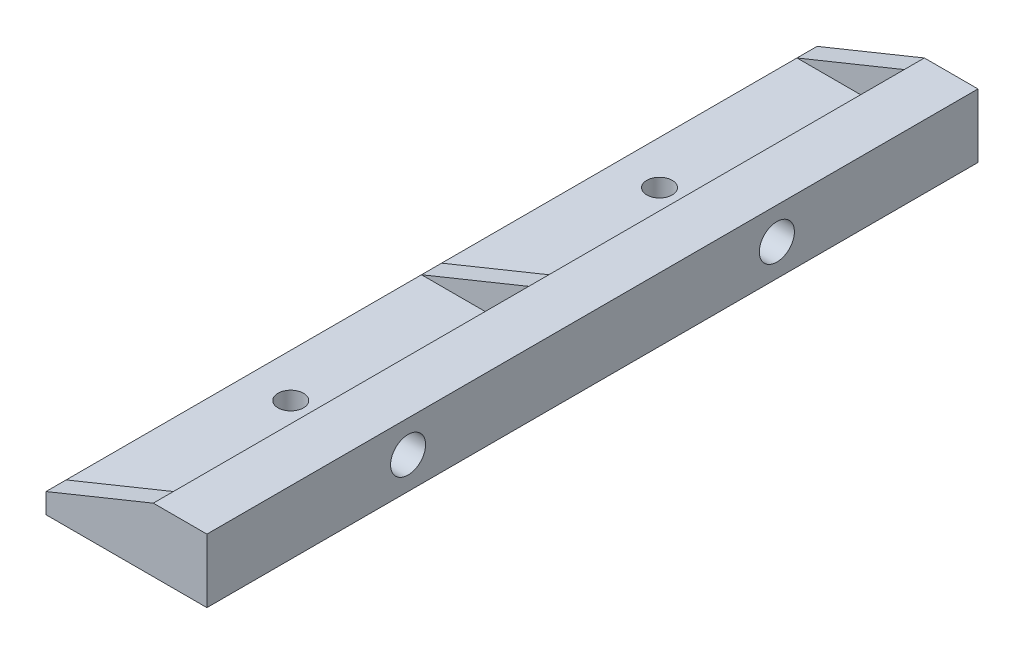
ISO-10303-21;
HEADER;
FILE_DESCRIPTION(('STEP AP214'),'2;1');
FILE_NAME('part.step','',(''),(''),'','','');
FILE_SCHEMA(('AUTOMOTIVE_DESIGN { 1 0 10303 214 1 1 1 1 }'));
ENDSEC;
DATA;
#1=APPLICATION_CONTEXT('core data for automotive mechanical design processes');
#2=APPLICATION_PROTOCOL_DEFINITION('international standard','automotive_design',2000,#1);
#3=PRODUCT_CONTEXT('',#1,'mechanical');
#4=PRODUCT('Part','Part','',(#3));
#5=PRODUCT_RELATED_PRODUCT_CATEGORY('part','',(#4));
#6=PRODUCT_DEFINITION_FORMATION('','',#4);
#7=PRODUCT_DEFINITION_CONTEXT('part definition',#1,'design');
#8=PRODUCT_DEFINITION('design','',#6,#7);
#9=PRODUCT_DEFINITION_SHAPE('','',#8);
#10=(LENGTH_UNIT() NAMED_UNIT(*) SI_UNIT(.MILLI.,.METRE.));
#11=(NAMED_UNIT(*) PLANE_ANGLE_UNIT() SI_UNIT($,.RADIAN.));
#12=(NAMED_UNIT(*) SI_UNIT($,.STERADIAN.) SOLID_ANGLE_UNIT());
#13=UNCERTAINTY_MEASURE_WITH_UNIT(LENGTH_MEASURE(1.E-05),#10,'distance_accuracy_value','');
#14=(GEOMETRIC_REPRESENTATION_CONTEXT(3) GLOBAL_UNCERTAINTY_ASSIGNED_CONTEXT((#13)) GLOBAL_UNIT_ASSIGNED_CONTEXT((#10,
#11,#12)) REPRESENTATION_CONTEXT('',''));
#15=CARTESIAN_POINT('',(0.,0.,0.));
#16=DIRECTION('',(0.,0.,1.));
#17=DIRECTION('',(1.,0.,0.));
#18=AXIS2_PLACEMENT_3D('',#15,#16,#17);
#19=CARTESIAN_POINT('',(-11.,6.,115.));
#20=DIRECTION('',(0.,0.,-1.));
#21=DIRECTION('',(-1.,0.,0.));
#22=AXIS2_PLACEMENT_3D('',#19,#20,#21);
#23=CYLINDRICAL_SURFACE('',#22,3.);
#24=CARTESIAN_POINT('',(-11.,6.,112.));
#25=DIRECTION('',(0.,0.,1.));
#26=DIRECTION('',(1.,0.,0.));
#27=AXIS2_PLACEMENT_3D('',#24,#25,#26);
#28=CIRCLE('',#27,3.);
#29=CARTESIAN_POINT('',(-8.,6.,112.));
#30=VERTEX_POINT('',#29);
#31=CARTESIAN_POINT('',(-11.,3.,112.));
#32=VERTEX_POINT('',#31);
#33=EDGE_CURVE('E231',#30,#32,#28,.F.);
#34=ORIENTED_EDGE('',*,*,#33,.F.);
#35=DIRECTION('',(0.,0.,-1.));
#36=VECTOR('',#35,1.);
#37=CARTESIAN_POINT('',(-8.,6.,115.));
#38=LINE('',#37,#36);
#39=CARTESIAN_POINT('',(-8.,6.,59.));
#40=VERTEX_POINT('',#39);
#41=EDGE_CURVE('E177',#30,#40,#38,.T.);
#42=ORIENTED_EDGE('',*,*,#41,.T.);
#43=CARTESIAN_POINT('',(-11.,6.,59.));
#44=DIRECTION('',(0.,0.,-1.));
#45=DIRECTION('',(-1.,0.,0.));
#46=AXIS2_PLACEMENT_3D('',#43,#44,#45);
#47=CIRCLE('',#46,3.);
#48=CARTESIAN_POINT('',(-11.,3.,59.));
#49=VERTEX_POINT('',#48);
#50=EDGE_CURVE('E208',#49,#40,#47,.F.);
#51=ORIENTED_EDGE('',*,*,#50,.F.);
#52=DIRECTION('',(0.,0.,-1.));
#53=VECTOR('',#52,1.);
#54=CARTESIAN_POINT('',(-11.,3.,115.));
#55=LINE('',#54,#53);
#56=EDGE_CURVE('E280',#32,#49,#55,.T.);
#57=ORIENTED_EDGE('',*,*,#56,.F.);
#58=EDGE_LOOP('',(#34,#42,#51,#57));
#59=FACE_BOUND('',#58,.T.);
#60=ADVANCED_FACE('F38',(#59),#23,.F.);
#61=CARTESIAN_POINT('',(-11.,3.,115.));
#62=DIRECTION('',(0.,-1.,0.));
#63=DIRECTION('',(1.,0.,0.));
#64=AXIS2_PLACEMENT_3D('',#61,#62,#63);
#65=PLANE('',#64);
#66=CARTESIAN_POINT('',(-17.5,3.,85.));
#67=DIRECTION('',(0.,-1.,0.));
#68=DIRECTION('',(1.,0.,0.));
#69=AXIS2_PLACEMENT_3D('',#66,#67,#68);
#70=CIRCLE('',#69,1.89865);
#71=CARTESIAN_POINT('',(-15.60135,3.,85.));
#72=VERTEX_POINT('',#71);
#73=EDGE_CURVE('E238',#72,#72,#70,.T.);
#74=ORIENTED_EDGE('',*,*,#73,.T.);
#75=EDGE_LOOP('',(#74));
#76=FACE_BOUND('',#75,.T.);
#77=DIRECTION('',(-1.,0.,0.));
#78=VECTOR('',#77,1.);
#79=CARTESIAN_POINT('',(-11.,3.,112.));
#80=LINE('',#79,#78);
#81=CARTESIAN_POINT('',(-24.,3.,112.));
#82=VERTEX_POINT('',#81);
#83=EDGE_CURVE('E235',#32,#82,#80,.T.);
#84=ORIENTED_EDGE('',*,*,#83,.F.);
#85=ORIENTED_EDGE('',*,*,#56,.T.);
#86=DIRECTION('',(1.,0.,0.));
#87=VECTOR('',#86,1.);
#88=CARTESIAN_POINT('',(-11.,3.,59.));
#89=LINE('',#88,#87);
#90=CARTESIAN_POINT('',(-24.,3.,59.));
#91=VERTEX_POINT('',#90);
#92=EDGE_CURVE('E212',#91,#49,#89,.T.);
#93=ORIENTED_EDGE('',*,*,#92,.F.);
#94=DIRECTION('',(0.,0.,-1.));
#95=VECTOR('',#94,1.);
#96=CARTESIAN_POINT('',(-24.,3.,115.));
#97=LINE('',#96,#95);
#98=EDGE_CURVE('E284',#82,#91,#97,.T.);
#99=ORIENTED_EDGE('',*,*,#98,.F.);
#100=EDGE_LOOP('',(#84,#85,#93,#99));
#101=FACE_BOUND('',#100,.T.);
#102=ADVANCED_FACE('F325',(#76,#101),#65,.F.);
#103=CARTESIAN_POINT('',(-8.,9.5,115.));
#104=DIRECTION('',(1.,0.,0.));
#105=DIRECTION('',(0.,0.,-1.));
#106=AXIS2_PLACEMENT_3D('',#103,#104,#105);
#107=PLANE('',#106);
#108=DIRECTION('',(0.,-1.,0.));
#109=VECTOR('',#108,1.);
#110=CARTESIAN_POINT('',(-8.,9.5,112.));
#111=LINE('',#110,#109);
#112=CARTESIAN_POINT('',(-8.,9.5,112.));
#113=VERTEX_POINT('',#112);
#114=EDGE_CURVE('E148',#113,#30,#111,.T.);
#115=ORIENTED_EDGE('',*,*,#114,.F.);
#116=DIRECTION('',(0.,0.,-1.));
#117=VECTOR('',#116,1.);
#118=CARTESIAN_POINT('',(-8.,9.5,115.));
#119=LINE('',#118,#117);
#120=CARTESIAN_POINT('',(-8.,9.5,59.));
#121=VERTEX_POINT('',#120);
#122=EDGE_CURVE('E163',#113,#121,#119,.T.);
#123=ORIENTED_EDGE('',*,*,#122,.T.);
#124=DIRECTION('',(0.,1.,0.));
#125=VECTOR('',#124,1.);
#126=CARTESIAN_POINT('',(-8.,9.5,59.));
#127=LINE('',#126,#125);
#128=EDGE_CURVE('E277',#40,#121,#127,.T.);
#129=ORIENTED_EDGE('',*,*,#128,.F.);
#130=ORIENTED_EDGE('',*,*,#41,.F.);
#131=EDGE_LOOP('',(#115,#123,#129,#130));
#132=FACE_BOUND('',#131,.T.);
#133=ADVANCED_FACE('F331',(#132),#107,.F.);
#134=CARTESIAN_POINT('',(-11.,6.,3.));
#135=DIRECTION('',(0.,0.,-1.));
#136=DIRECTION('',(-1.,0.,0.));
#137=AXIS2_PLACEMENT_3D('',#134,#135,#136);
#138=CIRCLE('',#137,3.);
#139=CARTESIAN_POINT('',(-11.,3.,3.));
#140=VERTEX_POINT('',#139);
#141=CARTESIAN_POINT('',(-8.,6.,3.));
#142=VERTEX_POINT('',#141);
#143=EDGE_CURVE('E55',#140,#142,#138,.F.);
#144=ORIENTED_EDGE('',*,*,#143,.F.);
#145=CARTESIAN_POINT('',(-11.,3.,56.));
#146=VERTEX_POINT('',#145);
#147=EDGE_CURVE('E282',#146,#140,#55,.T.);
#148=ORIENTED_EDGE('',*,*,#147,.F.);
#149=CARTESIAN_POINT('',(-11.,6.,56.));
#150=DIRECTION('',(0.,0.,-1.));
#151=DIRECTION('',(-1.,0.,0.));
#152=AXIS2_PLACEMENT_3D('',#149,#150,#151);
#153=CIRCLE('',#152,3.);
#154=CARTESIAN_POINT('',(-8.,6.,56.));
#155=VERTEX_POINT('',#154);
#156=EDGE_CURVE('E206',#146,#155,#153,.F.);
#157=ORIENTED_EDGE('',*,*,#156,.T.);
#158=EDGE_CURVE('E158',#155,#142,#38,.T.);
#159=ORIENTED_EDGE('',*,*,#158,.T.);
#160=EDGE_LOOP('',(#144,#148,#157,#159));
#161=FACE_BOUND('',#160,.T.);
#162=ADVANCED_FACE('F40',(#161),#23,.F.);
#163=CARTESIAN_POINT('',(-17.5,3.,30.));
#164=DIRECTION('',(0.,-1.,0.));
#165=DIRECTION('',(1.,0.,0.));
#166=AXIS2_PLACEMENT_3D('',#163,#164,#165);
#167=CIRCLE('',#166,1.89865);
#168=CARTESIAN_POINT('',(-15.60135,3.,30.));
#169=VERTEX_POINT('',#168);
#170=EDGE_CURVE('E243',#169,#169,#167,.T.);
#171=ORIENTED_EDGE('',*,*,#170,.T.);
#172=EDGE_LOOP('',(#171));
#173=FACE_BOUND('',#172,.T.);
#174=DIRECTION('',(1.,0.,0.));
#175=VECTOR('',#174,1.);
#176=CARTESIAN_POINT('',(-11.,3.,3.));
#177=LINE('',#176,#175);
#178=CARTESIAN_POINT('',(-24.,3.,3.));
#179=VERTEX_POINT('',#178);
#180=EDGE_CURVE('E62',#179,#140,#177,.T.);
#181=ORIENTED_EDGE('',*,*,#180,.F.);
#182=CARTESIAN_POINT('',(-24.,3.,56.));
#183=VERTEX_POINT('',#182);
#184=EDGE_CURVE('E285',#183,#179,#97,.T.);
#185=ORIENTED_EDGE('',*,*,#184,.F.);
#186=DIRECTION('',(1.,0.,0.));
#187=VECTOR('',#186,1.);
#188=CARTESIAN_POINT('',(-11.,3.,56.));
#189=LINE('',#188,#187);
#190=EDGE_CURVE('E205',#183,#146,#189,.T.);
#191=ORIENTED_EDGE('',*,*,#190,.T.);
#192=ORIENTED_EDGE('',*,*,#147,.T.);
#193=EDGE_LOOP('',(#181,#185,#191,#192));
#194=FACE_BOUND('',#193,.T.);
#195=ADVANCED_FACE('F333',(#173,#194),#65,.F.);
#196=DIRECTION('',(0.,1.,0.));
#197=VECTOR('',#196,1.);
#198=CARTESIAN_POINT('',(-8.,9.5,3.));
#199=LINE('',#198,#197);
#200=CARTESIAN_POINT('',(-8.,9.5,3.));
#201=VERTEX_POINT('',#200);
#202=EDGE_CURVE('E12',#142,#201,#199,.T.);
#203=ORIENTED_EDGE('',*,*,#202,.F.);
#204=ORIENTED_EDGE('',*,*,#158,.F.);
#205=DIRECTION('',(0.,1.,0.));
#206=VECTOR('',#205,1.);
#207=CARTESIAN_POINT('',(-8.,9.5,56.));
#208=LINE('',#207,#206);
#209=CARTESIAN_POINT('',(-8.,9.5,56.));
#210=VERTEX_POINT('',#209);
#211=EDGE_CURVE('E47',#155,#210,#208,.T.);
#212=ORIENTED_EDGE('',*,*,#211,.T.);
#213=EDGE_CURVE('E169',#210,#201,#119,.T.);
#214=ORIENTED_EDGE('',*,*,#213,.T.);
#215=EDGE_LOOP('',(#203,#204,#212,#214));
#216=FACE_BOUND('',#215,.T.);
#217=ADVANCED_FACE('F309',(#216),#107,.F.);
#218=CARTESIAN_POINT('',(-24.,3.,115.));
#219=DIRECTION('',(1.,0.,0.));
#220=DIRECTION('',(0.,0.,-1.));
#221=AXIS2_PLACEMENT_3D('',#218,#219,#220);
#222=PLANE('',#221);
#223=CARTESIAN_POINT('',(-24.,3.,115.));
#224=VERTEX_POINT('',#223);
#225=EDGE_CURVE('E145',#224,#82,#97,.T.);
#226=ORIENTED_EDGE('',*,*,#225,.T.);
#227=ORIENTED_EDGE('',*,*,#98,.T.);
#228=DIRECTION('',(0.,0.,-1.));
#229=VECTOR('',#228,1.);
#230=CARTESIAN_POINT('',(-24.,3.,115.));
#231=LINE('',#230,#229);
#232=EDGE_CURVE('E197',#183,#91,#231,.F.);
#233=ORIENTED_EDGE('',*,*,#232,.F.);
#234=ORIENTED_EDGE('',*,*,#184,.T.);
#235=DIRECTION('',(0.,0.,-1.));
#236=VECTOR('',#235,1.);
#237=CARTESIAN_POINT('',(-24.,3.,115.));
#238=LINE('',#237,#236);
#239=CARTESIAN_POINT('',(-24.,3.,0.));
#240=VERTEX_POINT('',#239);
#241=EDGE_CURVE('E222',#240,#179,#238,.F.);
#242=ORIENTED_EDGE('',*,*,#241,.F.);
#243=DIRECTION('',(0.,-1.,0.));
#244=VECTOR('',#243,1.);
#245=CARTESIAN_POINT('',(-24.,3.,0.));
#246=LINE('',#245,#244);
#247=CARTESIAN_POINT('',(-24.,0.,0.));
#248=VERTEX_POINT('',#247);
#249=EDGE_CURVE('E195',#240,#248,#246,.T.);
#250=ORIENTED_EDGE('',*,*,#249,.T.);
#251=DIRECTION('',(0.,0.,-1.));
#252=VECTOR('',#251,1.);
#253=CARTESIAN_POINT('',(-24.,0.,115.));
#254=LINE('',#253,#252);
#255=CARTESIAN_POINT('',(-24.,0.,115.));
#256=VERTEX_POINT('',#255);
#257=EDGE_CURVE('E286',#256,#248,#254,.T.);
#258=ORIENTED_EDGE('',*,*,#257,.F.);
#259=DIRECTION('',(0.,-1.,0.));
#260=VECTOR('',#259,1.);
#261=CARTESIAN_POINT('',(-24.,3.,115.));
#262=LINE('',#261,#260);
#263=EDGE_CURVE('E188',#224,#256,#262,.T.);
#264=ORIENTED_EDGE('',*,*,#263,.F.);
#265=EDGE_LOOP('',(#226,#227,#233,#234,#242,#250,#258,#264));
#266=FACE_BOUND('',#265,.T.);
#267=ADVANCED_FACE('F320',(#266),#222,.F.);
#268=CARTESIAN_POINT('',(-24.,0.,115.));
#269=DIRECTION('',(0.,1.,0.));
#270=DIRECTION('',(0.,0.,1.));
#271=AXIS2_PLACEMENT_3D('',#268,#269,#270);
#272=PLANE('',#271);
#273=CARTESIAN_POINT('',(-17.5,0.,30.));
#274=DIRECTION('',(0.,-1.,0.));
#275=DIRECTION('',(0.,0.,-1.));
#276=AXIS2_PLACEMENT_3D('',#273,#274,#275);
#277=CIRCLE('',#276,1.89865);
#278=CARTESIAN_POINT('',(-17.5,0.,28.10135));
#279=VERTEX_POINT('',#278);
#280=EDGE_CURVE('E246',#279,#279,#277,.T.);
#281=ORIENTED_EDGE('',*,*,#280,.F.);
#282=EDGE_LOOP('',(#281));
#283=FACE_BOUND('',#282,.T.);
#284=CARTESIAN_POINT('',(-17.5,0.,85.));
#285=DIRECTION('',(0.,-1.,0.));
#286=DIRECTION('',(0.,0.,-1.));
#287=AXIS2_PLACEMENT_3D('',#284,#285,#286);
#288=CIRCLE('',#287,1.89865);
#289=CARTESIAN_POINT('',(-17.5,0.,83.10135));
#290=VERTEX_POINT('',#289);
#291=EDGE_CURVE('E240',#290,#290,#288,.T.);
#292=ORIENTED_EDGE('',*,*,#291,.F.);
#293=EDGE_LOOP('',(#292));
#294=FACE_BOUND('',#293,.T.);
#295=ORIENTED_EDGE('',*,*,#257,.T.);
#296=DIRECTION('',(1.,0.,0.));
#297=VECTOR('',#296,1.);
#298=CARTESIAN_POINT('',(-24.,0.,0.));
#299=LINE('',#298,#297);
#300=CARTESIAN_POINT('',(0.,0.,0.));
#301=VERTEX_POINT('',#300);
#302=EDGE_CURVE('E192',#248,#301,#299,.T.);
#303=ORIENTED_EDGE('',*,*,#302,.T.);
#304=DIRECTION('',(0.,0.,-1.));
#305=VECTOR('',#304,1.);
#306=CARTESIAN_POINT('',(0.,0.,115.));
#307=LINE('',#306,#305);
#308=CARTESIAN_POINT('',(0.,0.,115.));
#309=VERTEX_POINT('',#308);
#310=EDGE_CURVE('E167',#309,#301,#307,.T.);
#311=ORIENTED_EDGE('',*,*,#310,.F.);
#312=DIRECTION('',(1.,0.,0.));
#313=VECTOR('',#312,1.);
#314=CARTESIAN_POINT('',(-24.,0.,115.));
#315=LINE('',#314,#313);
#316=EDGE_CURVE('E200',#256,#309,#315,.T.);
#317=ORIENTED_EDGE('',*,*,#316,.F.);
#318=EDGE_LOOP('',(#295,#303,#311,#317));
#319=FACE_BOUND('',#318,.T.);
#320=ADVANCED_FACE('F296',(#283,#294,#319),#272,.F.);
#321=CARTESIAN_POINT('',(0.,0.,115.));
#322=DIRECTION('',(-1.,0.,0.));
#323=DIRECTION('',(0.,0.,1.));
#324=AXIS2_PLACEMENT_3D('',#321,#322,#323);
#325=PLANE('',#324);
#326=CARTESIAN_POINT('',(0.,4.75,85.));
#327=DIRECTION('',(1.,0.,0.));
#328=DIRECTION('',(0.,0.,-1.));
#329=AXIS2_PLACEMENT_3D('',#326,#327,#328);
#330=CIRCLE('',#329,2.6162);
#331=CARTESIAN_POINT('',(0.,4.75,82.3838));
#332=VERTEX_POINT('',#331);
#333=EDGE_CURVE('E261',#332,#332,#330,.T.);
#334=ORIENTED_EDGE('',*,*,#333,.F.);
#335=EDGE_LOOP('',(#334));
#336=FACE_BOUND('',#335,.T.);
#337=CARTESIAN_POINT('',(0.,4.75,30.));
#338=DIRECTION('',(1.,0.,0.));
#339=DIRECTION('',(0.,0.,-1.));
#340=AXIS2_PLACEMENT_3D('',#337,#338,#339);
#341=CIRCLE('',#340,2.6162);
#342=CARTESIAN_POINT('',(0.,4.75,27.3838));
#343=VERTEX_POINT('',#342);
#344=EDGE_CURVE('E255',#343,#343,#341,.T.);
#345=ORIENTED_EDGE('',*,*,#344,.F.);
#346=EDGE_LOOP('',(#345));
#347=FACE_BOUND('',#346,.T.);
#348=ORIENTED_EDGE('',*,*,#310,.T.);
#349=DIRECTION('',(0.,1.,0.));
#350=VECTOR('',#349,1.);
#351=CARTESIAN_POINT('',(0.,0.,0.));
#352=LINE('',#351,#350);
#353=CARTESIAN_POINT('',(0.,9.5,0.));
#354=VERTEX_POINT('',#353);
#355=EDGE_CURVE('E189',#301,#354,#352,.T.);
#356=ORIENTED_EDGE('',*,*,#355,.T.);
#357=DIRECTION('',(0.,0.,-1.));
#358=VECTOR('',#357,1.);
#359=CARTESIAN_POINT('',(0.,9.5,115.));
#360=LINE('',#359,#358);
#361=CARTESIAN_POINT('',(0.,9.5,115.));
#362=VERTEX_POINT('',#361);
#363=EDGE_CURVE('E164',#362,#354,#360,.T.);
#364=ORIENTED_EDGE('',*,*,#363,.F.);
#365=DIRECTION('',(0.,1.,0.));
#366=VECTOR('',#365,1.);
#367=CARTESIAN_POINT('',(0.,0.,115.));
#368=LINE('',#367,#366);
#369=EDGE_CURVE('E155',#309,#362,#368,.T.);
#370=ORIENTED_EDGE('',*,*,#369,.F.);
#371=EDGE_LOOP('',(#348,#356,#364,#370));
#372=FACE_BOUND('',#371,.T.);
#373=ADVANCED_FACE('F290',(#336,#347,#372),#325,.F.);
#374=CARTESIAN_POINT('',(0.,9.5,115.));
#375=DIRECTION('',(0.,-1.,0.));
#376=DIRECTION('',(0.,0.,-1.));
#377=AXIS2_PLACEMENT_3D('',#374,#375,#376);
#378=PLANE('',#377);
#379=ORIENTED_EDGE('',*,*,#363,.T.);
#380=DIRECTION('',(-1.,0.,0.));
#381=VECTOR('',#380,1.);
#382=CARTESIAN_POINT('',(0.,9.5,0.));
#383=LINE('',#382,#381);
#384=CARTESIAN_POINT('',(-8.,9.5,0.));
#385=VERTEX_POINT('',#384);
#386=EDGE_CURVE('E186',#354,#385,#383,.T.);
#387=ORIENTED_EDGE('',*,*,#386,.T.);
#388=DIRECTION('',(0.,0.,-1.));
#389=VECTOR('',#388,1.);
#390=CARTESIAN_POINT('',(-8.,9.5,115.));
#391=LINE('',#390,#389);
#392=EDGE_CURVE('E225',#385,#201,#391,.F.);
#393=ORIENTED_EDGE('',*,*,#392,.T.);
#394=ORIENTED_EDGE('',*,*,#213,.F.);
#395=EDGE_CURVE('E166',#121,#210,#119,.T.);
#396=ORIENTED_EDGE('',*,*,#395,.F.);
#397=ORIENTED_EDGE('',*,*,#122,.F.);
#398=CARTESIAN_POINT('',(-8.,9.5,115.));
#399=VERTEX_POINT('',#398);
#400=EDGE_CURVE('E142',#399,#113,#119,.T.);
#401=ORIENTED_EDGE('',*,*,#400,.F.);
#402=DIRECTION('',(-1.,0.,0.));
#403=VECTOR('',#402,1.);
#404=CARTESIAN_POINT('',(0.,9.5,115.));
#405=LINE('',#404,#403);
#406=EDGE_CURVE('E152',#362,#399,#405,.T.);
#407=ORIENTED_EDGE('',*,*,#406,.F.);
#408=EDGE_LOOP('',(#379,#387,#393,#394,#396,#397,#401,#407));
#409=FACE_BOUND('',#408,.T.);
#410=ADVANCED_FACE('F161',(#409),#378,.F.);
#411=CARTESIAN_POINT('',(-11.,6.,115.));
#412=DIRECTION('',(0.,0.,-1.));
#413=DIRECTION('',(-1.,0.,0.));
#414=AXIS2_PLACEMENT_3D('',#411,#412,#413);
#415=PLANE('',#414);
#416=DIRECTION('',(-0.926466577122309,-0.376377046955938,0.));
#417=VECTOR('',#416,1.);
#418=CARTESIAN_POINT('',(-8.,9.5,115.));
#419=LINE('',#418,#417);
#420=EDGE_CURVE('E137',#399,#224,#419,.T.);
#421=ORIENTED_EDGE('',*,*,#420,.T.);
#422=ORIENTED_EDGE('',*,*,#263,.T.);
#423=ORIENTED_EDGE('',*,*,#316,.T.);
#424=ORIENTED_EDGE('',*,*,#369,.T.);
#425=ORIENTED_EDGE('',*,*,#406,.T.);
#426=EDGE_LOOP('',(#421,#422,#423,#424,#425));
#427=FACE_BOUND('',#426,.T.);
#428=ADVANCED_FACE('F153',(#427),#415,.F.);
#429=CARTESIAN_POINT('',(-11.,6.,0.));
#430=DIRECTION('',(0.,0.,-1.));
#431=DIRECTION('',(-1.,0.,0.));
#432=AXIS2_PLACEMENT_3D('',#429,#430,#431);
#433=PLANE('',#432);
#434=DIRECTION('',(-0.926466577122309,-0.376377046955938,0.));
#435=VECTOR('',#434,1.);
#436=CARTESIAN_POINT('',(-8.,9.5,0.));
#437=LINE('',#436,#435);
#438=EDGE_CURVE('E227',#385,#240,#437,.T.);
#439=ORIENTED_EDGE('',*,*,#438,.F.);
#440=ORIENTED_EDGE('',*,*,#386,.F.);
#441=ORIENTED_EDGE('',*,*,#355,.F.);
#442=ORIENTED_EDGE('',*,*,#302,.F.);
#443=ORIENTED_EDGE('',*,*,#249,.F.);
#444=EDGE_LOOP('',(#439,#440,#441,#442,#443));
#445=FACE_BOUND('',#444,.T.);
#446=ADVANCED_FACE('F300',(#445),#433,.T.);
#447=CARTESIAN_POINT('',(-8.,9.5,57.5));
#448=DIRECTION('',(0.376377046955938,-0.926466577122309,0.));
#449=DIRECTION('',(-0.926466577122309,-0.376377046955938,0.));
#450=AXIS2_PLACEMENT_3D('',#447,#448,#449);
#451=PLANE('',#450);
#452=DIRECTION('',(-0.926466577122309,-0.376377046955938,0.));
#453=VECTOR('',#452,1.);
#454=CARTESIAN_POINT('',(-8.,9.5,56.));
#455=LINE('',#454,#453);
#456=EDGE_CURVE('E215',#210,#183,#455,.T.);
#457=ORIENTED_EDGE('',*,*,#456,.T.);
#458=ORIENTED_EDGE('',*,*,#232,.T.);
#459=DIRECTION('',(-0.926466577122309,-0.376377046955938,0.));
#460=VECTOR('',#459,1.);
#461=CARTESIAN_POINT('',(-8.,9.5,59.));
#462=LINE('',#461,#460);
#463=EDGE_CURVE('E216',#121,#91,#462,.T.);
#464=ORIENTED_EDGE('',*,*,#463,.F.);
#465=ORIENTED_EDGE('',*,*,#395,.T.);
#466=EDGE_LOOP('',(#457,#458,#464,#465));
#467=FACE_BOUND('',#466,.T.);
#468=ADVANCED_FACE('F317',(#467),#451,.F.);
#469=CARTESIAN_POINT('',(-12.,4.75,56.));
#470=DIRECTION('',(0.,0.,-1.));
#471=DIRECTION('',(-1.,0.,0.));
#472=AXIS2_PLACEMENT_3D('',#469,#470,#471);
#473=PLANE('',#472);
#474=ORIENTED_EDGE('',*,*,#190,.F.);
#475=ORIENTED_EDGE('',*,*,#456,.F.);
#476=ORIENTED_EDGE('',*,*,#211,.F.);
#477=ORIENTED_EDGE('',*,*,#156,.F.);
#478=EDGE_LOOP('',(#474,#475,#476,#477));
#479=FACE_BOUND('',#478,.T.);
#480=ADVANCED_FACE('F313',(#479),#473,.T.);
#481=CARTESIAN_POINT('',(-12.,4.75,59.));
#482=DIRECTION('',(0.,0.,-1.));
#483=DIRECTION('',(-1.,0.,0.));
#484=AXIS2_PLACEMENT_3D('',#481,#482,#483);
#485=PLANE('',#484);
#486=ORIENTED_EDGE('',*,*,#92,.T.);
#487=ORIENTED_EDGE('',*,*,#50,.T.);
#488=ORIENTED_EDGE('',*,*,#128,.T.);
#489=ORIENTED_EDGE('',*,*,#463,.T.);
#490=EDGE_LOOP('',(#486,#487,#488,#489));
#491=FACE_BOUND('',#490,.T.);
#492=ADVANCED_FACE('F315',(#491),#485,.F.);
#493=CARTESIAN_POINT('',(-12.,4.75,3.));
#494=DIRECTION('',(0.,0.,-1.));
#495=DIRECTION('',(-1.,0.,0.));
#496=AXIS2_PLACEMENT_3D('',#493,#494,#495);
#497=PLANE('',#496);
#498=ORIENTED_EDGE('',*,*,#180,.T.);
#499=ORIENTED_EDGE('',*,*,#143,.T.);
#500=ORIENTED_EDGE('',*,*,#202,.T.);
#501=DIRECTION('',(-0.926466577122309,-0.376377046955938,0.));
#502=VECTOR('',#501,1.);
#503=CARTESIAN_POINT('',(-8.,9.5,3.));
#504=LINE('',#503,#502);
#505=EDGE_CURVE('E228',#201,#179,#504,.T.);
#506=ORIENTED_EDGE('',*,*,#505,.T.);
#507=EDGE_LOOP('',(#498,#499,#500,#506));
#508=FACE_BOUND('',#507,.T.);
#509=ADVANCED_FACE('F307',(#508),#497,.F.);
#510=CARTESIAN_POINT('',(-8.,9.5,0.));
#511=DIRECTION('',(0.376377046955938,-0.926466577122309,0.));
#512=DIRECTION('',(-0.926466577122309,-0.376377046955938,0.));
#513=AXIS2_PLACEMENT_3D('',#510,#511,#512);
#514=PLANE('',#513);
#515=ORIENTED_EDGE('',*,*,#438,.T.);
#516=ORIENTED_EDGE('',*,*,#241,.T.);
#517=ORIENTED_EDGE('',*,*,#505,.F.);
#518=ORIENTED_EDGE('',*,*,#392,.F.);
#519=EDGE_LOOP('',(#515,#516,#517,#518));
#520=FACE_BOUND('',#519,.T.);
#521=ADVANCED_FACE('F304',(#520),#514,.F.);
#522=CARTESIAN_POINT('',(-12.,4.75,112.));
#523=DIRECTION('',(0.,0.,1.));
#524=DIRECTION('',(1.,0.,0.));
#525=AXIS2_PLACEMENT_3D('',#522,#523,#524);
#526=PLANE('',#525);
#527=ORIENTED_EDGE('',*,*,#114,.T.);
#528=ORIENTED_EDGE('',*,*,#33,.T.);
#529=ORIENTED_EDGE('',*,*,#83,.T.);
#530=DIRECTION('',(-0.926466577122309,-0.376377046955938,0.));
#531=VECTOR('',#530,1.);
#532=CARTESIAN_POINT('',(-8.,9.5,112.));
#533=LINE('',#532,#531);
#534=EDGE_CURVE('E149',#113,#82,#533,.T.);
#535=ORIENTED_EDGE('',*,*,#534,.F.);
#536=EDGE_LOOP('',(#527,#528,#529,#535));
#537=FACE_BOUND('',#536,.T.);
#538=ADVANCED_FACE('F376',(#537),#526,.F.);
#539=CARTESIAN_POINT('',(-8.,9.5,115.));
#540=DIRECTION('',(-0.376377046955938,0.926466577122309,0.));
#541=DIRECTION('',(-0.926466577122309,-0.376377046955938,0.));
#542=AXIS2_PLACEMENT_3D('',#539,#540,#541);
#543=PLANE('',#542);
#544=ORIENTED_EDGE('',*,*,#534,.T.);
#545=ORIENTED_EDGE('',*,*,#225,.F.);
#546=ORIENTED_EDGE('',*,*,#420,.F.);
#547=ORIENTED_EDGE('',*,*,#400,.T.);
#548=EDGE_LOOP('',(#544,#545,#546,#547));
#549=FACE_BOUND('',#548,.T.);
#550=ADVANCED_FACE('F140',(#549),#543,.T.);
#551=CARTESIAN_POINT('',(-17.5,0.,85.));
#552=DIRECTION('',(0.,-1.,0.));
#553=DIRECTION('',(0.,0.,-1.));
#554=AXIS2_PLACEMENT_3D('',#551,#552,#553);
#555=CYLINDRICAL_SURFACE('',#554,1.89865);
#556=ORIENTED_EDGE('',*,*,#291,.T.);
#557=EDGE_LOOP('',(#556));
#558=FACE_BOUND('',#557,.T.);
#559=ORIENTED_EDGE('',*,*,#73,.F.);
#560=EDGE_LOOP('',(#559));
#561=FACE_BOUND('',#560,.T.);
#562=ADVANCED_FACE('F381',(#558,#561),#555,.F.);
#563=CARTESIAN_POINT('',(-17.5,0.,30.));
#564=DIRECTION('',(0.,-1.,0.));
#565=DIRECTION('',(0.,0.,-1.));
#566=AXIS2_PLACEMENT_3D('',#563,#564,#565);
#567=CYLINDRICAL_SURFACE('',#566,1.89865);
#568=ORIENTED_EDGE('',*,*,#280,.T.);
#569=EDGE_LOOP('',(#568));
#570=FACE_BOUND('',#569,.T.);
#571=ORIENTED_EDGE('',*,*,#170,.F.);
#572=EDGE_LOOP('',(#571));
#573=FACE_BOUND('',#572,.T.);
#574=ADVANCED_FACE('F387',(#570,#573),#567,.F.);
#575=CARTESIAN_POINT('',(-6.35,4.75,85.));
#576=DIRECTION('',(1.,0.,0.));
#577=DIRECTION('',(0.,0.,-1.));
#578=AXIS2_PLACEMENT_3D('',#575,#576,#577);
#579=PLANE('',#578);
#580=CARTESIAN_POINT('',(-6.35,4.75,85.));
#581=DIRECTION('',(1.,0.,0.));
#582=DIRECTION('',(0.,0.,-1.));
#583=AXIS2_PLACEMENT_3D('',#580,#581,#582);
#584=CIRCLE('',#583,2.6162);
#585=CARTESIAN_POINT('',(-6.35,4.75,82.3838));
#586=VERTEX_POINT('',#585);
#587=EDGE_CURVE('E264',#586,#586,#584,.T.);
#588=ORIENTED_EDGE('',*,*,#587,.T.);
#589=EDGE_LOOP('',(#588));
#590=FACE_BOUND('',#589,.T.);
#591=CARTESIAN_POINT('',(-6.35,4.75,85.));
#592=DIRECTION('',(1.,0.,0.));
#593=DIRECTION('',(0.,0.,-1.));
#594=AXIS2_PLACEMENT_3D('',#591,#592,#593);
#595=CIRCLE('',#594,2.3495);
#596=CARTESIAN_POINT('',(-6.35,4.75,82.6505));
#597=VERTEX_POINT('',#596);
#598=EDGE_CURVE('E266',#597,#597,#595,.F.);
#599=ORIENTED_EDGE('',*,*,#598,.T.);
#600=EDGE_LOOP('',(#599));
#601=FACE_BOUND('',#600,.T.);
#602=ADVANCED_FACE('F391',(#590,#601),#579,.T.);
#603=CARTESIAN_POINT('',(-6.35,4.75,85.));
#604=DIRECTION('',(1.,0.,0.));
#605=DIRECTION('',(0.,0.,-1.));
#606=AXIS2_PLACEMENT_3D('',#603,#604,#605);
#607=CYLINDRICAL_SURFACE('',#606,2.6162);
#608=ORIENTED_EDGE('',*,*,#587,.F.);
#609=EDGE_LOOP('',(#608));
#610=FACE_BOUND('',#609,.T.);
#611=ORIENTED_EDGE('',*,*,#333,.T.);
#612=EDGE_LOOP('',(#611));
#613=FACE_BOUND('',#612,.T.);
#614=ADVANCED_FACE('F416',(#610,#613),#607,.F.);
#615=CARTESIAN_POINT('',(-6.35,4.75,30.));
#616=DIRECTION('',(1.,0.,0.));
#617=DIRECTION('',(0.,0.,-1.));
#618=AXIS2_PLACEMENT_3D('',#615,#616,#617);
#619=PLANE('',#618);
#620=CARTESIAN_POINT('',(-6.35,4.75,30.));
#621=DIRECTION('',(1.,0.,0.));
#622=DIRECTION('',(0.,0.,-1.));
#623=AXIS2_PLACEMENT_3D('',#620,#621,#622);
#624=CIRCLE('',#623,2.6162);
#625=CARTESIAN_POINT('',(-6.35,4.75,27.3838));
#626=VERTEX_POINT('',#625);
#627=EDGE_CURVE('E258',#626,#626,#624,.T.);
#628=ORIENTED_EDGE('',*,*,#627,.T.);
#629=EDGE_LOOP('',(#628));
#630=FACE_BOUND('',#629,.T.);
#631=CARTESIAN_POINT('',(-6.35,4.75,30.));
#632=DIRECTION('',(1.,0.,0.));
#633=DIRECTION('',(0.,0.,-1.));
#634=AXIS2_PLACEMENT_3D('',#631,#632,#633);
#635=CIRCLE('',#634,2.3495);
#636=CARTESIAN_POINT('',(-6.35,4.75,27.6505));
#637=VERTEX_POINT('',#636);
#638=EDGE_CURVE('E42',#637,#637,#635,.F.);
#639=ORIENTED_EDGE('',*,*,#638,.T.);
#640=EDGE_LOOP('',(#639));
#641=FACE_BOUND('',#640,.T.);
#642=ADVANCED_FACE('F412',(#630,#641),#619,.T.);
#643=CARTESIAN_POINT('',(-6.35,4.75,30.));
#644=DIRECTION('',(1.,0.,0.));
#645=DIRECTION('',(0.,0.,-1.));
#646=AXIS2_PLACEMENT_3D('',#643,#644,#645);
#647=CYLINDRICAL_SURFACE('',#646,2.6162);
#648=ORIENTED_EDGE('',*,*,#627,.F.);
#649=EDGE_LOOP('',(#648));
#650=FACE_BOUND('',#649,.T.);
#651=ORIENTED_EDGE('',*,*,#344,.T.);
#652=EDGE_LOOP('',(#651));
#653=FACE_BOUND('',#652,.T.);
#654=ADVANCED_FACE('F408',(#650,#653),#647,.F.);
#655=CARTESIAN_POINT('',(-7.,9.5,115.));
#656=DIRECTION('',(1.,0.,0.));
#657=DIRECTION('',(0.,0.,-1.));
#658=AXIS2_PLACEMENT_3D('',#655,#656,#657);
#659=PLANE('',#658);
#660=CARTESIAN_POINT('',(-7.,4.75,85.));
#661=DIRECTION('',(1.,0.,0.));
#662=DIRECTION('',(0.,0.,-1.));
#663=AXIS2_PLACEMENT_3D('',#660,#661,#662);
#664=CIRCLE('',#663,2.3495);
#665=CARTESIAN_POINT('',(-7.,4.75,82.6505));
#666=VERTEX_POINT('',#665);
#667=EDGE_CURVE('E249',#666,#666,#664,.F.);
#668=ORIENTED_EDGE('',*,*,#667,.F.);
#669=EDGE_LOOP('',(#668));
#670=FACE_BOUND('',#669,.T.);
#671=ADVANCED_FACE('F404',(#670),#659,.T.);
#672=CARTESIAN_POINT('',(-14.6453895295912,4.75,85.));
#673=DIRECTION('',(1.,0.,0.));
#674=DIRECTION('',(0.,0.,-1.));
#675=AXIS2_PLACEMENT_3D('',#672,#673,#674);
#676=CYLINDRICAL_SURFACE('',#675,2.3495);
#677=ORIENTED_EDGE('',*,*,#667,.T.);
#678=EDGE_LOOP('',(#677));
#679=FACE_BOUND('',#678,.T.);
#680=ORIENTED_EDGE('',*,*,#598,.F.);
#681=EDGE_LOOP('',(#680));
#682=FACE_BOUND('',#681,.T.);
#683=ADVANCED_FACE('F400',(#679,#682),#676,.F.);
#684=CARTESIAN_POINT('',(-7.,9.5,115.));
#685=DIRECTION('',(1.,0.,0.));
#686=DIRECTION('',(0.,0.,-1.));
#687=AXIS2_PLACEMENT_3D('',#684,#685,#686);
#688=PLANE('',#687);
#689=CARTESIAN_POINT('',(-7.,4.75,30.));
#690=DIRECTION('',(1.,0.,0.));
#691=DIRECTION('',(0.,0.,-1.));
#692=AXIS2_PLACEMENT_3D('',#689,#690,#691);
#693=CIRCLE('',#692,2.3495);
#694=CARTESIAN_POINT('',(-7.,4.75,27.6505));
#695=VERTEX_POINT('',#694);
#696=EDGE_CURVE('E250',#695,#695,#693,.F.);
#697=ORIENTED_EDGE('',*,*,#696,.F.);
#698=EDGE_LOOP('',(#697));
#699=FACE_BOUND('',#698,.T.);
#700=ADVANCED_FACE('F396',(#699),#688,.T.);
#701=CARTESIAN_POINT('',(-14.6453895295912,4.75,30.));
#702=DIRECTION('',(1.,0.,0.));
#703=DIRECTION('',(0.,0.,-1.));
#704=AXIS2_PLACEMENT_3D('',#701,#702,#703);
#705=CYLINDRICAL_SURFACE('',#704,2.3495);
#706=ORIENTED_EDGE('',*,*,#696,.T.);
#707=EDGE_LOOP('',(#706));
#708=FACE_BOUND('',#707,.T.);
#709=ORIENTED_EDGE('',*,*,#638,.F.);
#710=EDGE_LOOP('',(#709));
#711=FACE_BOUND('',#710,.T.);
#712=ADVANCED_FACE('F393',(#708,#711),#705,.F.);
#713=CLOSED_SHELL('',(#60,#102,#133,#162,#195,#217,#267,#320,#373,#410,#428,#446,#468,#480,#492,
#509,#521,#538,#550,#562,#574,#602,#614,#642,#654,#671,#683,#700,#712));
#714=MANIFOLD_SOLID_BREP('B2',#713);
#715=ADVANCED_BREP_SHAPE_REPRESENTATION('',(#18,#714),#14);
#716=SHAPE_DEFINITION_REPRESENTATION(#9,#715);
ENDSEC;
END-ISO-10303-21;
